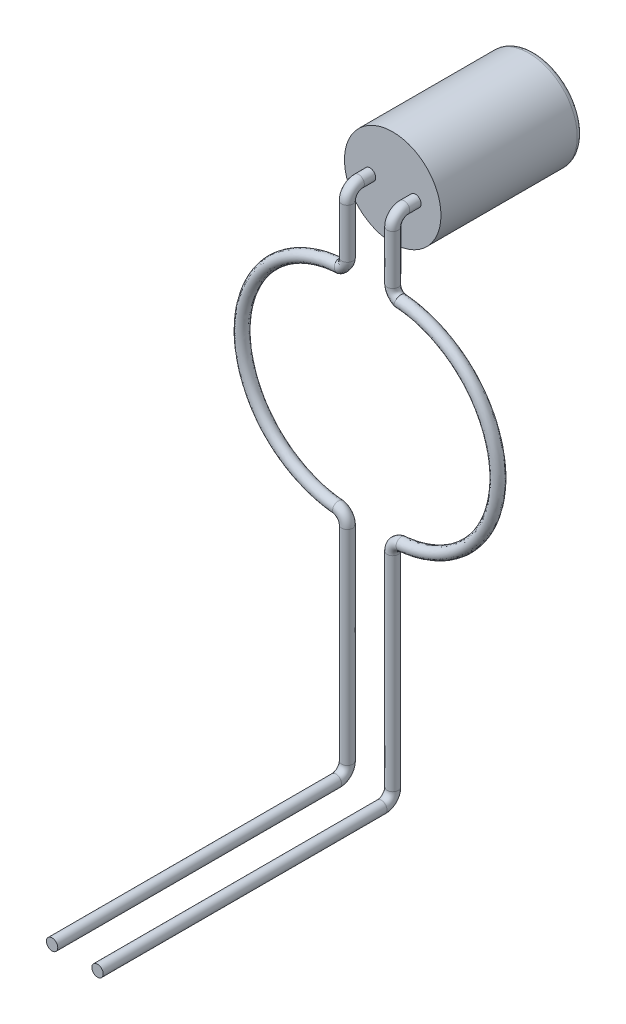
ISO-10303-21;
HEADER;
FILE_DESCRIPTION(('STEP AP214'),'2;1');
FILE_NAME('part.step','',(''),(''),'','','');
FILE_SCHEMA(('AUTOMOTIVE_DESIGN { 1 0 10303 214 1 1 1 1 }'));
ENDSEC;
DATA;
#1=APPLICATION_CONTEXT('core data for automotive mechanical design processes');
#2=APPLICATION_PROTOCOL_DEFINITION('international standard','automotive_design',2000,#1);
#3=PRODUCT_CONTEXT('',#1,'mechanical');
#4=PRODUCT('Part','Part','',(#3));
#5=PRODUCT_RELATED_PRODUCT_CATEGORY('part','',(#4));
#6=PRODUCT_DEFINITION_FORMATION('','',#4);
#7=PRODUCT_DEFINITION_CONTEXT('part definition',#1,'design');
#8=PRODUCT_DEFINITION('design','',#6,#7);
#9=PRODUCT_DEFINITION_SHAPE('','',#8);
#10=(LENGTH_UNIT() NAMED_UNIT(*) SI_UNIT(.MILLI.,.METRE.));
#11=(NAMED_UNIT(*) PLANE_ANGLE_UNIT() SI_UNIT($,.RADIAN.));
#12=(NAMED_UNIT(*) SI_UNIT($,.STERADIAN.) SOLID_ANGLE_UNIT());
#13=UNCERTAINTY_MEASURE_WITH_UNIT(LENGTH_MEASURE(1.E-05),#10,'distance_accuracy_value','');
#14=(GEOMETRIC_REPRESENTATION_CONTEXT(3) GLOBAL_UNCERTAINTY_ASSIGNED_CONTEXT((#13)) GLOBAL_UNIT_ASSIGNED_CONTEXT((#10,
#11,#12)) REPRESENTATION_CONTEXT('',''));
#15=CARTESIAN_POINT('',(0.,0.,0.));
#16=DIRECTION('',(0.,0.,1.));
#17=DIRECTION('',(1.,0.,0.));
#18=AXIS2_PLACEMENT_3D('',#15,#16,#17);
#19=CARTESIAN_POINT('',(0.,0.,1.25));
#20=DIRECTION('',(0.,0.,-1.));
#21=DIRECTION('',(-1.,0.,0.));
#22=AXIS2_PLACEMENT_3D('',#19,#20,#21);
#23=CYLINDRICAL_SURFACE('',#22,0.85);
#24=CARTESIAN_POINT('',(0.,0.,-1.15));
#25=DIRECTION('',(0.,0.,1.));
#26=DIRECTION('',(1.,0.,0.));
#27=AXIS2_PLACEMENT_3D('',#24,#25,#26);
#28=CIRCLE('',#27,0.85);
#29=CARTESIAN_POINT('',(0.85,0.,-1.15));
#30=VERTEX_POINT('',#29);
#31=EDGE_CURVE('E342',#30,#30,#28,.T.);
#32=ORIENTED_EDGE('',*,*,#31,.T.);
#33=EDGE_LOOP('',(#32));
#34=FACE_BOUND('',#33,.T.);
#35=CARTESIAN_POINT('',(0.,0.,1.25));
#36=DIRECTION('',(0.,0.,1.));
#37=DIRECTION('',(1.,0.,0.));
#38=AXIS2_PLACEMENT_3D('',#35,#36,#37);
#39=CIRCLE('',#38,0.85);
#40=CARTESIAN_POINT('',(0.85,0.,1.25));
#41=VERTEX_POINT('',#40);
#42=EDGE_CURVE('E197',#41,#41,#39,.T.);
#43=ORIENTED_EDGE('',*,*,#42,.F.);
#44=EDGE_LOOP('',(#43));
#45=FACE_BOUND('',#44,.T.);
#46=ADVANCED_FACE('F45',(#34,#45),#23,.T.);
#47=CARTESIAN_POINT('',(0.,0.,1.25));
#48=DIRECTION('',(0.,0.,1.));
#49=DIRECTION('',(1.,0.,0.));
#50=AXIS2_PLACEMENT_3D('',#47,#48,#49);
#51=PLANE('',#50);
#52=CARTESIAN_POINT('',(0.4,0.,1.25));
#53=DIRECTION('',(0.,0.,1.));
#54=DIRECTION('',(1.,0.,0.));
#55=AXIS2_PLACEMENT_3D('',#52,#53,#54);
#56=CIRCLE('',#55,0.1);
#57=CARTESIAN_POINT('',(0.5,0.,1.25));
#58=VERTEX_POINT('',#57);
#59=EDGE_CURVE('E11',#58,#58,#56,.T.);
#60=ORIENTED_EDGE('',*,*,#59,.F.);
#61=EDGE_LOOP('',(#60));
#62=FACE_BOUND('',#61,.T.);
#63=CARTESIAN_POINT('',(-0.4,0.,1.25));
#64=DIRECTION('',(0.,0.,1.));
#65=DIRECTION('',(1.,0.,0.));
#66=AXIS2_PLACEMENT_3D('',#63,#64,#65);
#67=CIRCLE('',#66,0.1);
#68=CARTESIAN_POINT('',(-0.3,0.,1.25));
#69=VERTEX_POINT('',#68);
#70=EDGE_CURVE('E53',#69,#69,#67,.T.);
#71=ORIENTED_EDGE('',*,*,#70,.F.);
#72=EDGE_LOOP('',(#71));
#73=FACE_BOUND('',#72,.T.);
#74=ORIENTED_EDGE('',*,*,#42,.T.);
#75=EDGE_LOOP('',(#74));
#76=FACE_BOUND('',#75,.T.);
#77=ADVANCED_FACE('F146',(#62,#73,#76),#51,.T.);
#78=CARTESIAN_POINT('',(0.,0.,-1.25));
#79=DIRECTION('',(0.,0.,1.));
#80=DIRECTION('',(1.,0.,0.));
#81=AXIS2_PLACEMENT_3D('',#78,#79,#80);
#82=PLANE('',#81);
#83=CARTESIAN_POINT('',(0.,0.,-1.25));
#84=DIRECTION('',(0.,0.,1.));
#85=DIRECTION('',(1.,0.,0.));
#86=AXIS2_PLACEMENT_3D('',#83,#84,#85);
#87=CIRCLE('',#86,0.75);
#88=CARTESIAN_POINT('',(0.75,0.,-1.25));
#89=VERTEX_POINT('',#88);
#90=EDGE_CURVE('E340',#89,#89,#87,.F.);
#91=ORIENTED_EDGE('',*,*,#90,.T.);
#92=EDGE_LOOP('',(#91));
#93=FACE_BOUND('',#92,.T.);
#94=ADVANCED_FACE('F152',(#93),#82,.F.);
#95=CARTESIAN_POINT('',(0.,0.,-1.15));
#96=DIRECTION('',(0.,0.,1.));
#97=DIRECTION('',(1.,0.,0.));
#98=AXIS2_PLACEMENT_3D('',#95,#96,#97);
#99=TOROIDAL_SURFACE('',#98,0.75,0.1);
#100=ORIENTED_EDGE('',*,*,#90,.F.);
#101=EDGE_LOOP('',(#100));
#102=FACE_BOUND('',#101,.T.);
#103=ORIENTED_EDGE('',*,*,#31,.F.);
#104=EDGE_LOOP('',(#103));
#105=FACE_BOUND('',#104,.T.);
#106=ADVANCED_FACE('F47',(#102,#105),#99,.T.);
#107=CARTESIAN_POINT('',(-0.399999999999998,-8.94598900638172,6.85));
#108=DIRECTION('',(0.,0.,1.));
#109=DIRECTION('',(1.,0.,0.));
#110=AXIS2_PLACEMENT_3D('',#107,#108,#109);
#111=PLANE('',#110);
#112=CARTESIAN_POINT('',(-0.399999999999998,-8.94598900638172,6.85));
#113=DIRECTION('',(0.,0.,1.));
#114=DIRECTION('',(1.,0.,0.));
#115=AXIS2_PLACEMENT_3D('',#112,#113,#114);
#116=CIRCLE('',#115,0.1);
#117=CARTESIAN_POINT('',(-0.299999999999998,-8.94598900638172,6.85));
#118=VERTEX_POINT('',#117);
#119=EDGE_CURVE('E58',#118,#118,#116,.T.);
#120=ORIENTED_EDGE('',*,*,#119,.T.);
#121=EDGE_LOOP('',(#120));
#122=FACE_BOUND('',#121,.T.);
#123=ADVANCED_FACE('F122',(#122),#111,.T.);
#124=CARTESIAN_POINT('',(-0.6,-5.14598900638171,1.65));
#125=DIRECTION('',(0.,0.,-1.));
#126=DIRECTION('',(-1.,0.,0.));
#127=AXIS2_PLACEMENT_3D('',#124,#125,#126);
#128=TOROIDAL_SURFACE('',#127,0.200000000000002,0.1);
#129=CARTESIAN_POINT('',(-0.399999999999999,-5.14598900638171,1.65));
#130=DIRECTION('',(0.,-1.,0.));
#131=DIRECTION('',(1.,0.,0.));
#132=AXIS2_PLACEMENT_3D('',#129,#130,#131);
#133=CIRCLE('',#132,0.1);
#134=CARTESIAN_POINT('',(-0.299999999999999,-5.14598900638171,1.65));
#135=VERTEX_POINT('',#134);
#136=EDGE_CURVE('E94',#135,#135,#133,.T.);
#137=ORIENTED_EDGE('',*,*,#136,.F.);
#138=EDGE_LOOP('',(#137));
#139=FACE_BOUND('',#138,.T.);
#140=CARTESIAN_POINT('',(-0.560183047886554,-4.9499925515046,1.65));
#141=DIRECTION('',(0.996254962561394,-0.086464151946315,0.));
#142=DIRECTION('',(0.0864641519463149,0.996254962561394,0.));
#143=AXIS2_PLACEMENT_3D('',#140,#141,#142);
#144=CIRCLE('',#143,0.1);
#145=CARTESIAN_POINT('',(-0.545905602260877,-4.85118068965726,1.65));
#146=VERTEX_POINT('',#145);
#147=EDGE_CURVE('E63',#146,#146,#144,.T.);
#148=ORIENTED_EDGE('',*,*,#147,.T.);
#149=EDGE_LOOP('',(#148));
#150=FACE_BOUND('',#149,.T.);
#151=ADVANCED_FACE('F162',(#139,#150),#128,.T.);
#152=CARTESIAN_POINT('',(-0.399999999999998,-5.14598900638171,1.65));
#153=DIRECTION('',(0.,-1.,0.));
#154=DIRECTION('',(0.,0.,-1.));
#155=AXIS2_PLACEMENT_3D('',#152,#153,#154);
#156=CYLINDRICAL_SURFACE('',#155,0.1);
#157=CARTESIAN_POINT('',(-0.399999999999998,-8.74598900638171,1.65));
#158=DIRECTION('',(0.,-1.,0.));
#159=DIRECTION('',(1.,0.,0.));
#160=AXIS2_PLACEMENT_3D('',#157,#158,#159);
#161=CIRCLE('',#160,0.1);
#162=CARTESIAN_POINT('',(-0.399999999999998,-8.74598900638171,1.55));
#163=VERTEX_POINT('',#162);
#164=EDGE_CURVE('E97',#163,#163,#161,.T.);
#165=ORIENTED_EDGE('',*,*,#164,.F.);
#166=EDGE_LOOP('',(#165));
#167=FACE_BOUND('',#166,.T.);
#168=ORIENTED_EDGE('',*,*,#136,.T.);
#169=EDGE_LOOP('',(#168));
#170=FACE_BOUND('',#169,.T.);
#171=ADVANCED_FACE('F171',(#167,#170),#156,.T.);
#172=CARTESIAN_POINT('',(-0.399999999999998,-8.74598900638171,1.85));
#173=DIRECTION('',(-1.,0.,0.));
#174=DIRECTION('',(0.,0.,1.));
#175=AXIS2_PLACEMENT_3D('',#172,#173,#174);
#176=TOROIDAL_SURFACE('',#175,0.200000000000001,0.1);
#177=CARTESIAN_POINT('',(-0.399999999999998,-8.94598900638171,1.85));
#178=DIRECTION('',(0.,0.,1.));
#179=DIRECTION('',(1.,0.,0.));
#180=AXIS2_PLACEMENT_3D('',#177,#178,#179);
#181=CIRCLE('',#180,0.1);
#182=CARTESIAN_POINT('',(-0.399999999999998,-9.04598900638171,1.85));
#183=VERTEX_POINT('',#182);
#184=EDGE_CURVE('E564',#183,#183,#181,.T.);
#185=CARTESIAN_POINT('',(-0.399999999999998,-8.74598900638171,1.85));
#186=DIRECTION('',(-1.,0.,0.));
#187=DIRECTION('',(0.,0.,1.));
#188=AXIS2_PLACEMENT_3D('',#185,#186,#187);
#189=CIRCLE('',#188,0.3);
#190=EDGE_CURVE('',#163,#183,#189,.T.);
#191=ORIENTED_EDGE('',*,*,#164,.T.);
#192=ORIENTED_EDGE('',*,*,#184,.F.);
#193=ORIENTED_EDGE('',*,*,#190,.T.);
#194=ORIENTED_EDGE('',*,*,#190,.F.);
#195=EDGE_LOOP('',(#191,#193,#192,#194));
#196=FACE_BOUND('',#195,.T.);
#197=ADVANCED_FACE('F167',(#196),#176,.T.);
#198=CARTESIAN_POINT('',(-0.399999999999998,-8.94598900638172,1.85));
#199=DIRECTION('',(0.,0.,1.));
#200=DIRECTION('',(1.,0.,0.));
#201=AXIS2_PLACEMENT_3D('',#198,#199,#200);
#202=CYLINDRICAL_SURFACE('',#201,0.1);
#203=ORIENTED_EDGE('',*,*,#119,.F.);
#204=EDGE_LOOP('',(#203));
#205=FACE_BOUND('',#204,.T.);
#206=ORIENTED_EDGE('',*,*,#184,.T.);
#207=EDGE_LOOP('',(#206));
#208=FACE_BOUND('',#207,.T.);
#209=ADVANCED_FACE('F163',(#205,#208),#202,.T.);
#210=CARTESIAN_POINT('',(-0.320313914255039,-1.3421668293797,1.65));
#211=CARTESIAN_POINT('',(-0.386824528835957,-1.3467256222584,1.65));
#212=CARTESIAN_POINT('',(-0.455131011311232,-1.35139897748724,1.65));
#213=CARTESIAN_POINT('',(-0.968453973995265,-1.38665099806308,1.65));
#214=CARTESIAN_POINT('',(-1.37636483013981,-1.58494097054743,1.65));
#215=CARTESIAN_POINT('',(-1.97464763676664,-2.21983956312003,1.65));
#216=CARTESIAN_POINT('',(-2.14856734212054,-2.65227258517285,1.65));
#217=CARTESIAN_POINT('',(-2.15647835242533,-3.52461247584773,1.65));
#218=CARTESIAN_POINT('',(-1.9904298387068,-3.96012857608279,1.65));
#219=CARTESIAN_POINT('',(-1.40375992577032,-4.60577317864002,1.65));
#220=CARTESIAN_POINT('',(-0.987092950947682,-4.81256547595763,1.65));
#221=CARTESIAN_POINT('',(-0.551536632691923,-4.85036705524846,1.65));
#222=CARTESIAN_POINT('',(-0.320313914255039,-1.3421668293797,1.85));
#223=CARTESIAN_POINT('',(-0.386824528835957,-1.3467256222584,1.85));
#224=CARTESIAN_POINT('',(-0.455131011311232,-1.35139897748724,1.85));
#225=CARTESIAN_POINT('',(-0.968453973995265,-1.38665099806308,1.85));
#226=CARTESIAN_POINT('',(-1.37636483013981,-1.58494097054743,1.85));
#227=CARTESIAN_POINT('',(-1.97464763676664,-2.21983956312003,1.85));
#228=CARTESIAN_POINT('',(-2.14856734212049,-2.65227258517285,1.85));
#229=CARTESIAN_POINT('',(-2.15647835242538,-3.52461247584773,1.85));
#230=CARTESIAN_POINT('',(-1.9904298387068,-3.96012857608279,1.85));
#231=CARTESIAN_POINT('',(-1.40375992577032,-4.60577317864002,1.85));
#232=CARTESIAN_POINT('',(-0.987092950947782,-4.81256547595773,1.85));
#233=CARTESIAN_POINT('',(-0.551536632691923,-4.85036705524846,1.85));
#234=CARTESIAN_POINT('',(-0.333990292891106,-1.1426349856369,1.85));
#235=CARTESIAN_POINT('',(-0.400500907472024,-1.1471937785156,1.85));
#236=CARTESIAN_POINT('',(-0.465217348780653,-1.15162009045159,1.85));
#237=CARTESIAN_POINT('',(-1.00701682821201,-1.18883167977311,1.85));
#238=CARTESIAN_POINT('',(-1.48778416885489,-1.4115529619925,1.85));
#239=CARTESIAN_POINT('',(-2.15434091635022,-2.11890396082949,1.85));
#240=CARTESIAN_POINT('',(-2.34810773004086,-2.60068472654156,1.85));
#241=CARTESIAN_POINT('',(-2.35692151716598,-3.57257299375931,1.85));
#242=CARTESIAN_POINT('',(-2.17192412796356,-4.05778866774967,1.85));
#243=CARTESIAN_POINT('',(-1.51830549696017,-4.77711197363766,1.85));
#244=CARTESIAN_POINT('',(-1.05408994463249,-5.00750268448573,1.85));
#245=CARTESIAN_POINT('',(-0.568829463081186,-5.04961804776074,1.85));
#246=CARTESIAN_POINT('',(-0.333990292891106,-1.1426349856369,1.65));
#247=CARTESIAN_POINT('',(-0.400500907472024,-1.1471937785156,1.65));
#248=CARTESIAN_POINT('',(-0.465217348780653,-1.15162009045159,1.65));
#249=CARTESIAN_POINT('',(-1.00701682821201,-1.18883167977311,1.65));
#250=CARTESIAN_POINT('',(-1.48778416885489,-1.4115529619925,1.65));
#251=CARTESIAN_POINT('',(-2.15434091635022,-2.11890396082949,1.65));
#252=CARTESIAN_POINT('',(-2.34810773004091,-2.60068472654156,1.65));
#253=CARTESIAN_POINT('',(-2.35692151716593,-3.57257299375931,1.65));
#254=CARTESIAN_POINT('',(-2.17192412796353,-4.05778866774967,1.65));
#255=CARTESIAN_POINT('',(-1.51830549696019,-4.77711197363766,1.65));
#256=CARTESIAN_POINT('',(-1.05408994463249,-5.00750268448573,1.65));
#257=CARTESIAN_POINT('',(-0.568829463081186,-5.04961804776074,1.65));
#258=CARTESIAN_POINT('',(-0.333990292891106,-1.1426349856369,1.45));
#259=CARTESIAN_POINT('',(-0.400500907472024,-1.1471937785156,1.45));
#260=CARTESIAN_POINT('',(-0.465217348780653,-1.15162009045159,1.45));
#261=CARTESIAN_POINT('',(-1.00701682821201,-1.18883167977311,1.45));
#262=CARTESIAN_POINT('',(-1.48778416885489,-1.4115529619925,1.45));
#263=CARTESIAN_POINT('',(-2.15434091635022,-2.11890396082949,1.45));
#264=CARTESIAN_POINT('',(-2.34810773004096,-2.60068472654156,1.45));
#265=CARTESIAN_POINT('',(-2.35692151716588,-3.57257299375931,1.45));
#266=CARTESIAN_POINT('',(-2.17192412796351,-4.05778866774967,1.45));
#267=CARTESIAN_POINT('',(-1.51830549696022,-4.77711197363766,1.45));
#268=CARTESIAN_POINT('',(-1.05408994463249,-5.00750268448573,1.45));
#269=CARTESIAN_POINT('',(-0.568829463081186,-5.04961804776074,1.45));
#270=CARTESIAN_POINT('',(-0.320313914255039,-1.3421668293797,1.45));
#271=CARTESIAN_POINT('',(-0.386824528835957,-1.3467256222584,1.45));
#272=CARTESIAN_POINT('',(-0.455131011311232,-1.35139897748724,1.45));
#273=CARTESIAN_POINT('',(-0.968453973995265,-1.38665099806308,1.45));
#274=CARTESIAN_POINT('',(-1.37636483013981,-1.58494097054743,1.45));
#275=CARTESIAN_POINT('',(-1.97464763676664,-2.21983956312003,1.45));
#276=CARTESIAN_POINT('',(-2.14856734212059,-2.65227258517285,1.45));
#277=CARTESIAN_POINT('',(-2.15647835242528,-3.52461247584773,1.45));
#278=CARTESIAN_POINT('',(-1.9904298387068,-3.96012857608279,1.45));
#279=CARTESIAN_POINT('',(-1.40375992577032,-4.60577317864002,1.45));
#280=CARTESIAN_POINT('',(-0.987092950947582,-4.81256547595753,1.45));
#281=CARTESIAN_POINT('',(-0.551536632691923,-4.85036705524846,1.45));
#282=CARTESIAN_POINT('',(-0.320313914255039,-1.3421668293797,1.65));
#283=CARTESIAN_POINT('',(-0.386824528835957,-1.3467256222584,1.65));
#284=CARTESIAN_POINT('',(-0.455131011311232,-1.35139897748724,1.65));
#285=CARTESIAN_POINT('',(-0.968453973995265,-1.38665099806308,1.65));
#286=CARTESIAN_POINT('',(-1.37636483013981,-1.58494097054743,1.65));
#287=CARTESIAN_POINT('',(-1.97464763676664,-2.21983956312003,1.65));
#288=CARTESIAN_POINT('',(-2.14856734212054,-2.65227258517285,1.65));
#289=CARTESIAN_POINT('',(-2.15647835242533,-3.52461247584773,1.65));
#290=CARTESIAN_POINT('',(-1.9904298387068,-3.96012857608279,1.65));
#291=CARTESIAN_POINT('',(-1.40375992577032,-4.60577317864002,1.65));
#292=CARTESIAN_POINT('',(-0.987092950947682,-4.81256547595763,1.65));
#293=CARTESIAN_POINT('',(-0.551536632691923,-4.85036705524846,1.65));
#294=(BOUNDED_SURFACE() B_SPLINE_SURFACE(3,3,((#210,#211,#212,#213,#214,#215,#216,#217,#218,
#219,#220,#221),(#222,#223,#224,#225,#226,#227,#228,#229,#230,#231,#232,#233),(#234,#235,#236,
#237,#238,#239,#240,#241,#242,#243,#244,#245),(#246,#247,#248,#249,#250,#251,#252,#253,#254,
#255,#256,#257),(#258,#259,#260,#261,#262,#263,#264,#265,#266,#267,#268,#269),(#270,#271,#272,
#273,#274,#275,#276,#277,#278,#279,#280,#281),(#282,#283,#284,#285,#286,#287,#288,#289,#290,
#291,#292,#293)),.UNSPECIFIED.,.T.,.F.,.F.) B_SPLINE_SURFACE_WITH_KNOTS((4,3,4),(4,2,2,2,2,4),
(0.,0.5,1.),(-0.0360641782622766,0.,0.25,0.5,0.75,1.),
.UNSPECIFIED.) GEOMETRIC_REPRESENTATION_ITEM() RATIONAL_B_SPLINE_SURFACE(((1.,1.,1.,1.,1.,1.,1.,
1.,1.,1.,1.,1.),(0.333333333333333,0.333333333333333,0.333333333333333,0.333333333333333,
0.333333333333333,0.333333333333333,0.333333333333333,0.333333333333333,0.333333333333333,
0.333333333333333,0.333333333333333,0.333333333333333),(0.333333333333333,0.333333333333333,
0.333333333333333,0.333333333333333,0.333333333333333,0.333333333333333,0.333333333333333,
0.333333333333333,0.333333333333333,0.333333333333333,0.333333333333333,0.333333333333333),(1.,
1.,1.,1.,1.,1.,1.,1.,1.,1.,1.,1.),(0.333333333333333,0.333333333333333,0.333333333333333,
0.333333333333333,0.333333333333333,0.333333333333333,0.333333333333333,0.333333333333333,
0.333333333333333,0.333333333333333,0.333333333333333,0.333333333333333),(0.333333333333333,
0.333333333333333,0.333333333333333,0.333333333333333,0.333333333333333,0.333333333333333,
0.333333333333333,0.333333333333333,0.333333333333333,0.333333333333333,0.333333333333333,
0.333333333333333),(1.,1.,1.,1.,1.,1.,1.,1.,1.,1.,1.,1.))) REPRESENTATION_ITEM('') SURFACE());
#295=CARTESIAN_POINT('',(-0.526683947315875,-1.25607728614437,1.55));
#296=CARTESIAN_POINT('',(-0.526416853962726,-1.25725743200403,1.54999945477346));
#297=CARTESIAN_POINT('',(-0.526149515452099,-1.25843865126105,1.55002098814878));
#298=CARTESIAN_POINT('',(-0.523151952408598,-1.27168309963214,1.55050810587876));
#299=CARTESIAN_POINT('',(-0.520416785252301,-1.28376719966588,1.55323687924054));
#300=CARTESIAN_POINT('',(-0.515545462847435,-1.30528780991801,1.56256131623488));
#301=CARTESIAN_POINT('',(-0.5133798274527,-1.31485464896088,1.5688529763735));
#302=CARTESIAN_POINT('',(-0.509651927393527,-1.33132244663684,1.58430611407469));
#303=CARTESIAN_POINT('',(-0.508084723168472,-1.3382452299072,1.5934429149672));
#304=CARTESIAN_POINT('',(-0.505735805218788,-1.34862094142141,1.6134579751396));
#305=CARTESIAN_POINT('',(-0.504945149076069,-1.35211337226941,1.62431469550801));
#306=CARTESIAN_POINT('',(-0.50421694911252,-1.35532992845187,1.64649164066506));
#307=CARTESIAN_POINT('',(-0.504271116002822,-1.35509066862818,1.65780627661743));
#308=CARTESIAN_POINT('',(-0.505203929941744,-1.35097029908951,1.67967041241208));
#309=CARTESIAN_POINT('',(-0.506079597249567,-1.34710235132699,1.69022252914732));
#310=CARTESIAN_POINT('',(-0.50855226210093,-1.33617997749352,1.70947546897725));
#311=CARTESIAN_POINT('',(-0.510152197741929,-1.32911257236364,1.71816853696748));
#312=CARTESIAN_POINT('',(-0.513928311275905,-1.31243169322777,1.73287772186388));
#313=CARTESIAN_POINT('',(-0.516116324004702,-1.30276592734387,1.73883115010044));
#314=CARTESIAN_POINT('',(-0.520829289634877,-1.28194473454604,1.74716931815929));
#315=CARTESIAN_POINT('',(-0.52335672014041,-1.2707783533225,1.74952607042707));
#316=CARTESIAN_POINT('',(-0.52614948929866,-1.25843876676343,1.74997891225516));
#317=CARTESIAN_POINT('',(-0.526416826865292,-1.25725755167308,1.7500004391514));
#318=CARTESIAN_POINT('',(-0.526683947315876,-1.25607728614437,1.75));
#319=B_SPLINE_CURVE_WITH_KNOTS('',3,(#295,#296,#297,#298,#299,#300,#301,#302,#303,#304,#305,
#306,#307,#308,#309,#310,#311,#312,#313,#314,#315,#316,#317,#318),.UNSPECIFIED.,.F.,.F.,(4,2,2,
2,2,2,2,2,2,2,2,4),(0.,0.00363296038412161,0.040727683527187,0.0750521251887425,
0.109086785135364,0.142724752316014,0.1760328777563,0.2092206533923,0.242544283442033,
0.276596547390638,0.310912461908523,0.314545422292646),.UNSPECIFIED.);
#320=CARTESIAN_POINT('',(-0.526683947315876,-1.25607728614437,1.75));
#321=VERTEX_POINT('',#320);
#322=CARTESIAN_POINT('',(-0.526683947315875,-1.25607728614437,1.55));
#323=VERTEX_POINT('',#322);
#324=EDGE_CURVE('E221',#321,#323,#319,.F.);
#325=CARTESIAN_POINT('',(-0.526683947315875,-1.25607728614437,1.55));
#326=CARTESIAN_POINT('',(-0.526951011568328,-1.25489711858859,1.54999947834686));
#327=CARTESIAN_POINT('',(-0.527219302755635,-1.25371611674632,1.55002100826793));
#328=CARTESIAN_POINT('',(-0.530237637364436,-1.24047709489119,1.55050773945927));
#329=CARTESIAN_POINT('',(-0.533086713823957,-1.22842068802513,1.55323290431081));
#330=CARTESIAN_POINT('',(-0.538220269939352,-1.20693489410127,1.56254755087526));
#331=CARTESIAN_POINT('',(-0.54053078977885,-1.19737794034182,1.56884020420876));
#332=CARTESIAN_POINT('',(-0.544469977956386,-1.18092774067056,1.58430618434828));
#333=CARTESIAN_POINT('',(-0.546104698873244,-1.17401089441268,1.59345259298921));
#334=CARTESIAN_POINT('',(-0.548503918550857,-1.16366132082313,1.61346218977642));
#335=CARTESIAN_POINT('',(-0.549280775302423,-1.16017919494375,1.6242983603883));
#336=CARTESIAN_POINT('',(-0.550000342610874,-1.15696137978385,1.64644787683648));
#337=CARTESIAN_POINT('',(-0.549949876718125,-1.15719504312278,1.65775655265758));
#338=CARTESIAN_POINT('',(-0.549028611683749,-1.16130253468337,1.6796404101379));
#339=CARTESIAN_POINT('',(-0.548158903426399,-1.16517152217384,1.69021654712764));
#340=CARTESIAN_POINT('',(-0.545617057652538,-1.17608540219437,1.7094810124055));
#341=CARTESIAN_POINT('',(-0.543943695003785,-1.18313514263175,1.71816642890583));
#342=CARTESIAN_POINT('',(-0.53998346628731,-1.19964931718217,1.7327636486787));
#343=CARTESIAN_POINT('',(-0.537691382203206,-1.20913425374877,1.73865062811258));
#344=CARTESIAN_POINT('',(-0.532740627117323,-1.22988584252071,1.74709535873414));
#345=CARTESIAN_POINT('',(-0.530071417990582,-1.24120604983144,1.74951970690956));
#346=CARTESIAN_POINT('',(-0.527219324528623,-1.25371603361262,1.74997892129478));
#347=CARTESIAN_POINT('',(-0.526951034038423,-1.25489703309873,1.75000044705368));
#348=CARTESIAN_POINT('',(-0.526683947315876,-1.25607728614437,1.75));
#349=B_SPLINE_CURVE_WITH_KNOTS('',3,(#325,#326,#327,#328,#329,#330,#331,#332,#333,#334,#335,
#336,#337,#338,#339,#340,#341,#342,#343,#344,#345,#346,#347,#348),.UNSPECIFIED.,.F.,.F.,(4,2,2,
2,2,2,2,2,2,2,2,4),(0.,0.00363296129542657,0.0407260078495858,0.0751094271185845,
0.109177857458853,0.142748838826554,0.176043075449436,0.20929304081002,0.242593855808893,
0.276184797826031,0.311037879845327,0.314670841140304),.UNSPECIFIED.);
#350=EDGE_CURVE('E223',#321,#323,#349,.F.);
#351=ORIENTED_EDGE('',*,*,#324,.F.);
#352=ORIENTED_EDGE('',*,*,#350,.T.);
#353=EDGE_LOOP('',(#351,#352));
#354=FACE_BOUND('',#353,.T.);
#355=ORIENTED_EDGE('',*,*,#147,.F.);
#356=EDGE_LOOP('',(#355));
#357=FACE_BOUND('',#356,.T.);
#358=ADVANCED_FACE('F166',(#354,#357),#294,.T.);
#359=CARTESIAN_POINT('',(-0.4,0.,1.25));
#360=DIRECTION('',(0.,0.,1.));
#361=DIRECTION('',(1.,0.,0.));
#362=AXIS2_PLACEMENT_3D('',#359,#360,#361);
#363=CYLINDRICAL_SURFACE('',#362,0.1);
#364=CARTESIAN_POINT('',(-0.4,0.,1.45));
#365=DIRECTION('',(0.,0.,1.));
#366=DIRECTION('',(1.,0.,0.));
#367=AXIS2_PLACEMENT_3D('',#364,#365,#366);
#368=CIRCLE('',#367,0.1);
#369=CARTESIAN_POINT('',(-0.4,0.1,1.45));
#370=VERTEX_POINT('',#369);
#371=EDGE_CURVE('E196',#370,#370,#368,.T.);
#372=ORIENTED_EDGE('',*,*,#371,.F.);
#373=EDGE_LOOP('',(#372));
#374=FACE_BOUND('',#373,.T.);
#375=ORIENTED_EDGE('',*,*,#70,.T.);
#376=EDGE_LOOP('',(#375));
#377=FACE_BOUND('',#376,.T.);
#378=ADVANCED_FACE('F212',(#374,#377),#363,.T.);
#379=CARTESIAN_POINT('',(-0.4,-0.2,1.45));
#380=DIRECTION('',(1.,0.,0.));
#381=DIRECTION('',(0.,0.,-1.));
#382=AXIS2_PLACEMENT_3D('',#379,#380,#381);
#383=TOROIDAL_SURFACE('',#382,0.2,0.1);
#384=CARTESIAN_POINT('',(-0.4,-0.2,1.65));
#385=DIRECTION('',(0.,-1.,0.));
#386=DIRECTION('',(1.,0.,0.));
#387=AXIS2_PLACEMENT_3D('',#384,#385,#386);
#388=CIRCLE('',#387,0.1);
#389=CARTESIAN_POINT('',(-0.4,-0.2,1.75));
#390=VERTEX_POINT('',#389);
#391=EDGE_CURVE('E231',#390,#390,#388,.T.);
#392=CARTESIAN_POINT('',(-0.4,-0.2,1.45));
#393=DIRECTION('',(1.,0.,0.));
#394=DIRECTION('',(0.,0.,-1.));
#395=AXIS2_PLACEMENT_3D('',#392,#393,#394);
#396=CIRCLE('',#395,0.3);
#397=EDGE_CURVE('',#370,#390,#396,.T.);
#398=ORIENTED_EDGE('',*,*,#371,.T.);
#399=ORIENTED_EDGE('',*,*,#391,.F.);
#400=ORIENTED_EDGE('',*,*,#397,.T.);
#401=ORIENTED_EDGE('',*,*,#397,.F.);
#402=EDGE_LOOP('',(#398,#400,#399,#401));
#403=FACE_BOUND('',#402,.T.);
#404=ADVANCED_FACE('F217',(#403),#383,.T.);
#405=CARTESIAN_POINT('',(-0.4,-0.2,1.65));
#406=DIRECTION('',(0.,-1.,0.));
#407=DIRECTION('',(0.,0.,-1.));
#408=AXIS2_PLACEMENT_3D('',#405,#406,#407);
#409=CYLINDRICAL_SURFACE('',#408,0.1);
#410=CARTESIAN_POINT('',(-0.4,-1.07,1.65));
#411=DIRECTION('',(0.,-1.,0.));
#412=DIRECTION('',(1.,0.,0.));
#413=AXIS2_PLACEMENT_3D('',#410,#411,#412);
#414=CIRCLE('',#413,0.1);
#415=CARTESIAN_POINT('',(-0.3,-1.07,1.65));
#416=VERTEX_POINT('',#415);
#417=EDGE_CURVE('E228',#416,#416,#414,.T.);
#418=ORIENTED_EDGE('',*,*,#417,.F.);
#419=EDGE_LOOP('',(#418));
#420=FACE_BOUND('',#419,.T.);
#421=ORIENTED_EDGE('',*,*,#391,.T.);
#422=EDGE_LOOP('',(#421));
#423=FACE_BOUND('',#422,.T.);
#424=ADVANCED_FACE('F252',(#420,#423),#409,.T.);
#425=CARTESIAN_POINT('',(-0.3,-1.07,1.65));
#426=CARTESIAN_POINT('',(-0.3,-1.16962213238677,1.65));
#427=CARTESIAN_POINT('',(-0.396075480806249,-1.31193580295551,1.65));
#428=CARTESIAN_POINT('',(-0.567500778193534,-1.37977597687934,1.65));
#429=CARTESIAN_POINT('',(-0.614077445069928,-1.39799329767264,1.65));
#430=CARTESIAN_POINT('',(-0.676103207118016,-1.4224319819007,1.65));
#431=CARTESIAN_POINT('',(-0.3,-1.07,1.85));
#432=CARTESIAN_POINT('',(-0.3,-1.16962213238677,1.85));
#433=CARTESIAN_POINT('',(-0.396075480806249,-1.31193580295551,1.85));
#434=CARTESIAN_POINT('',(-0.567500778193534,-1.37977597687934,1.85));
#435=CARTESIAN_POINT('',(-0.614077445069928,-1.39799329767264,1.85));
#436=CARTESIAN_POINT('',(-0.676103207118016,-1.4224319819007,1.85));
#437=CARTESIAN_POINT('',(-0.5,-1.07,1.85));
#438=CARTESIAN_POINT('',(-0.5,-1.12977327943208,1.85));
#439=CARTESIAN_POINT('',(-0.506953165494128,-1.14076668586535,1.85));
#440=CARTESIAN_POINT('',(-0.609842180080612,-1.18140488703589,1.85));
#441=CARTESIAN_POINT('',(-0.687393497754135,-1.2119160115284,1.85));
#442=CARTESIAN_POINT('',(-0.749419259802224,-1.23635469575645,1.85));
#443=CARTESIAN_POINT('',(-0.5,-1.07,1.65));
#444=CARTESIAN_POINT('',(-0.5,-1.12977327943208,1.65));
#445=CARTESIAN_POINT('',(-0.506953165494128,-1.14076668586535,1.65));
#446=CARTESIAN_POINT('',(-0.609842180080612,-1.18140488703589,1.65));
#447=CARTESIAN_POINT('',(-0.687393497754135,-1.2119160115284,1.65));
#448=CARTESIAN_POINT('',(-0.749419259802224,-1.23635469575645,1.65));
#449=CARTESIAN_POINT('',(-0.5,-1.07,1.45));
#450=CARTESIAN_POINT('',(-0.5,-1.12977327943208,1.45));
#451=CARTESIAN_POINT('',(-0.506953165494128,-1.14076668586535,1.45));
#452=CARTESIAN_POINT('',(-0.609842180080612,-1.18140488703589,1.45));
#453=CARTESIAN_POINT('',(-0.687393497754135,-1.2119160115284,1.45));
#454=CARTESIAN_POINT('',(-0.749419259802224,-1.23635469575645,1.45));
#455=CARTESIAN_POINT('',(-0.3,-1.07,1.45));
#456=CARTESIAN_POINT('',(-0.3,-1.16962213238677,1.45));
#457=CARTESIAN_POINT('',(-0.396075480806249,-1.31193580295551,1.45));
#458=CARTESIAN_POINT('',(-0.567500778193534,-1.37977597687934,1.45));
#459=CARTESIAN_POINT('',(-0.614077445069928,-1.39799329767264,1.45));
#460=CARTESIAN_POINT('',(-0.676103207118016,-1.4224319819007,1.45));
#461=CARTESIAN_POINT('',(-0.3,-1.07,1.65));
#462=CARTESIAN_POINT('',(-0.3,-1.16962213238677,1.65));
#463=CARTESIAN_POINT('',(-0.396075480806249,-1.31193580295551,1.65));
#464=CARTESIAN_POINT('',(-0.567500778193534,-1.37977597687934,1.65));
#465=CARTESIAN_POINT('',(-0.614077445069928,-1.39799329767264,1.65));
#466=CARTESIAN_POINT('',(-0.676103207118016,-1.4224319819007,1.65));
#467=(BOUNDED_SURFACE() B_SPLINE_SURFACE(3,3,((#425,#426,#427,#428,#429,#430),(#431,#432,#433,
#434,#435,#436),(#437,#438,#439,#440,#441,#442),(#443,#444,#445,#446,#447,#448),(#449,#450,#451,
#452,#453,#454),(#455,#456,#457,#458,#459,#460),(#461,#462,#463,#464,#465,#466)),.UNSPECIFIED.,
.T.,.F.,.F.) B_SPLINE_SURFACE_WITH_KNOTS((4,3,4),(4,2,4),(0.,0.5,1.),(0.852707366876897,1.,
1.12146271694297),.UNSPECIFIED.) GEOMETRIC_REPRESENTATION_ITEM() RATIONAL_B_SPLINE_SURFACE(((1.,
1.,1.,1.,1.,1.),(0.333333333333333,0.333333333333333,0.333333333333333,0.333333333333333,
0.333333333333333,0.333333333333333),(0.333333333333333,0.333333333333333,0.333333333333333,
0.333333333333333,0.333333333333333,0.333333333333333),(1.,1.,1.,1.,1.,1.),(0.333333333333333,
0.333333333333333,0.333333333333333,0.333333333333333,0.333333333333333,0.333333333333333),
(0.333333333333333,0.333333333333333,0.333333333333333,0.333333333333333,0.333333333333333,
0.333333333333333),(1.,1.,1.,1.,1.,1.))) REPRESENTATION_ITEM('') SURFACE());
#468=ORIENTED_EDGE('',*,*,#350,.F.);
#469=ORIENTED_EDGE('',*,*,#324,.T.);
#470=EDGE_LOOP('',(#468,#469));
#471=FACE_BOUND('',#470,.T.);
#472=ORIENTED_EDGE('',*,*,#417,.T.);
#473=EDGE_LOOP('',(#472));
#474=FACE_BOUND('',#473,.T.);
#475=ADVANCED_FACE('F226',(#471,#474),#467,.T.);
#476=CARTESIAN_POINT('',(0.399999999999998,-8.94598900638172,6.85));
#477=DIRECTION('',(0.,0.,1.));
#478=DIRECTION('',(-1.,0.,0.));
#479=AXIS2_PLACEMENT_3D('',#476,#477,#478);
#480=PLANE('',#479);
#481=CARTESIAN_POINT('',(0.399999999999998,-8.94598900638172,6.85));
#482=DIRECTION('',(0.,0.,-1.));
#483=DIRECTION('',(-1.,0.,0.));
#484=AXIS2_PLACEMENT_3D('',#481,#482,#483);
#485=CIRCLE('',#484,0.1);
#486=CARTESIAN_POINT('',(0.299999999999998,-8.94598900638172,6.85));
#487=VERTEX_POINT('',#486);
#488=EDGE_CURVE('E301',#487,#487,#485,.F.);
#489=ORIENTED_EDGE('',*,*,#488,.T.);
#490=EDGE_LOOP('',(#489));
#491=FACE_BOUND('',#490,.T.);
#492=ADVANCED_FACE('F251',(#491),#480,.T.);
#493=CARTESIAN_POINT('',(0.6,-5.14598900638171,1.65));
#494=DIRECTION('',(0.,0.,1.));
#495=DIRECTION('',(1.,0.,0.));
#496=AXIS2_PLACEMENT_3D('',#493,#494,#495);
#497=TOROIDAL_SURFACE('',#496,0.200000000000002,0.1);
#498=CARTESIAN_POINT('',(0.399999999999999,-5.14598900638171,1.65));
#499=DIRECTION('',(0.,1.,0.));
#500=DIRECTION('',(-1.,0.,0.));
#501=AXIS2_PLACEMENT_3D('',#498,#499,#500);
#502=CIRCLE('',#501,0.1);
#503=CARTESIAN_POINT('',(0.299999999999999,-5.14598900638171,1.65));
#504=VERTEX_POINT('',#503);
#505=EDGE_CURVE('E321',#504,#504,#502,.F.);
#506=ORIENTED_EDGE('',*,*,#505,.F.);
#507=EDGE_LOOP('',(#506));
#508=FACE_BOUND('',#507,.T.);
#509=CARTESIAN_POINT('',(0.560183047886554,-4.9499925515046,1.65));
#510=DIRECTION('',(0.996254962561394,0.086464151946315,0.));
#511=DIRECTION('',(-0.0864641519463149,0.996254962561394,0.));
#512=AXIS2_PLACEMENT_3D('',#509,#510,#511);
#513=CIRCLE('',#512,0.1);
#514=CARTESIAN_POINT('',(0.545905602260877,-4.85118068965726,1.65));
#515=VERTEX_POINT('',#514);
#516=EDGE_CURVE('E292',#515,#515,#513,.F.);
#517=ORIENTED_EDGE('',*,*,#516,.T.);
#518=EDGE_LOOP('',(#517));
#519=FACE_BOUND('',#518,.T.);
#520=ADVANCED_FACE('F267',(#508,#519),#497,.T.);
#521=CARTESIAN_POINT('',(0.399999999999998,-5.14598900638171,1.65));
#522=DIRECTION('',(0.,-1.,0.));
#523=DIRECTION('',(0.,0.,-1.));
#524=AXIS2_PLACEMENT_3D('',#521,#522,#523);
#525=CYLINDRICAL_SURFACE('',#524,0.1);
#526=CARTESIAN_POINT('',(0.399999999999998,-8.74598900638171,1.65));
#527=DIRECTION('',(0.,1.,0.));
#528=DIRECTION('',(-1.,0.,0.));
#529=AXIS2_PLACEMENT_3D('',#526,#527,#528);
#530=CIRCLE('',#529,0.1);
#531=CARTESIAN_POINT('',(0.399999999999998,-8.74598900638171,1.55));
#532=VERTEX_POINT('',#531);
#533=EDGE_CURVE('E319',#532,#532,#530,.F.);
#534=ORIENTED_EDGE('',*,*,#533,.F.);
#535=EDGE_LOOP('',(#534));
#536=FACE_BOUND('',#535,.T.);
#537=ORIENTED_EDGE('',*,*,#505,.T.);
#538=EDGE_LOOP('',(#537));
#539=FACE_BOUND('',#538,.T.);
#540=ADVANCED_FACE('F275',(#536,#539),#525,.T.);
#541=CARTESIAN_POINT('',(0.399999999999998,-8.74598900638171,1.85));
#542=DIRECTION('',(-1.,0.,0.));
#543=DIRECTION('',(0.,0.,1.));
#544=AXIS2_PLACEMENT_3D('',#541,#542,#543);
#545=TOROIDAL_SURFACE('',#544,0.200000000000001,0.1);
#546=CARTESIAN_POINT('',(0.399999999999998,-8.94598900638171,1.85));
#547=DIRECTION('',(0.,0.,-1.));
#548=DIRECTION('',(-1.,0.,0.));
#549=AXIS2_PLACEMENT_3D('',#546,#547,#548);
#550=CIRCLE('',#549,0.1);
#551=CARTESIAN_POINT('',(0.399999999999998,-9.04598900638171,1.85));
#552=VERTEX_POINT('',#551);
#553=EDGE_CURVE('E316',#552,#552,#550,.F.);
#554=CARTESIAN_POINT('',(0.399999999999998,-8.74598900638171,1.85));
#555=DIRECTION('',(-1.,0.,0.));
#556=DIRECTION('',(0.,0.,1.));
#557=AXIS2_PLACEMENT_3D('',#554,#555,#556);
#558=CIRCLE('',#557,0.3);
#559=EDGE_CURVE('',#532,#552,#558,.T.);
#560=ORIENTED_EDGE('',*,*,#533,.T.);
#561=ORIENTED_EDGE('',*,*,#553,.F.);
#562=ORIENTED_EDGE('',*,*,#559,.T.);
#563=ORIENTED_EDGE('',*,*,#559,.F.);
#564=EDGE_LOOP('',(#560,#562,#561,#563));
#565=FACE_BOUND('',#564,.T.);
#566=ADVANCED_FACE('F271',(#565),#545,.T.);
#567=CARTESIAN_POINT('',(0.399999999999998,-8.94598900638172,1.85));
#568=DIRECTION('',(0.,0.,1.));
#569=DIRECTION('',(1.,0.,0.));
#570=AXIS2_PLACEMENT_3D('',#567,#568,#569);
#571=CYLINDRICAL_SURFACE('',#570,0.1);
#572=ORIENTED_EDGE('',*,*,#488,.F.);
#573=EDGE_LOOP('',(#572));
#574=FACE_BOUND('',#573,.T.);
#575=ORIENTED_EDGE('',*,*,#553,.T.);
#576=EDGE_LOOP('',(#575));
#577=FACE_BOUND('',#576,.T.);
#578=ADVANCED_FACE('F142',(#574,#577),#571,.T.);
#579=CARTESIAN_POINT('',(0.320313914255039,-1.3421668293797,1.65));
#580=CARTESIAN_POINT('',(0.386824528835957,-1.3467256222584,1.65));
#581=CARTESIAN_POINT('',(0.455131011311232,-1.35139897748724,1.65));
#582=CARTESIAN_POINT('',(0.968453973995265,-1.38665099806308,1.65));
#583=CARTESIAN_POINT('',(1.37636483013981,-1.58494097054743,1.65));
#584=CARTESIAN_POINT('',(1.97464763676664,-2.21983956312003,1.65));
#585=CARTESIAN_POINT('',(2.14856734212054,-2.65227258517285,1.65));
#586=CARTESIAN_POINT('',(2.15647835242533,-3.52461247584773,1.65));
#587=CARTESIAN_POINT('',(1.9904298387068,-3.96012857608279,1.65));
#588=CARTESIAN_POINT('',(1.40375992577032,-4.60577317864002,1.65));
#589=CARTESIAN_POINT('',(0.987092950947682,-4.81256547595763,1.65));
#590=CARTESIAN_POINT('',(0.551536632691923,-4.85036705524846,1.65));
#591=CARTESIAN_POINT('',(0.320313914255039,-1.3421668293797,1.45));
#592=CARTESIAN_POINT('',(0.386824528835957,-1.3467256222584,1.45));
#593=CARTESIAN_POINT('',(0.455131011311232,-1.35139897748724,1.45));
#594=CARTESIAN_POINT('',(0.968453973995265,-1.38665099806308,1.45));
#595=CARTESIAN_POINT('',(1.37636483013981,-1.58494097054743,1.45));
#596=CARTESIAN_POINT('',(1.97464763676664,-2.21983956312003,1.45));
#597=CARTESIAN_POINT('',(2.14856734212059,-2.65227258517285,1.45));
#598=CARTESIAN_POINT('',(2.15647835242528,-3.52461247584773,1.45));
#599=CARTESIAN_POINT('',(1.9904298387068,-3.96012857608279,1.45));
#600=CARTESIAN_POINT('',(1.40375992577032,-4.60577317864002,1.45));
#601=CARTESIAN_POINT('',(0.987092950947582,-4.81256547595753,1.45));
#602=CARTESIAN_POINT('',(0.551536632691923,-4.85036705524846,1.45));
#603=CARTESIAN_POINT('',(0.333990292891106,-1.1426349856369,1.45));
#604=CARTESIAN_POINT('',(0.400500907472024,-1.1471937785156,1.45));
#605=CARTESIAN_POINT('',(0.465217348780653,-1.15162009045159,1.45));
#606=CARTESIAN_POINT('',(1.00701682821201,-1.18883167977311,1.45));
#607=CARTESIAN_POINT('',(1.48778416885489,-1.4115529619925,1.45));
#608=CARTESIAN_POINT('',(2.15434091635022,-2.11890396082949,1.45));
#609=CARTESIAN_POINT('',(2.34810773004096,-2.60068472654156,1.45));
#610=CARTESIAN_POINT('',(2.35692151716588,-3.57257299375931,1.45));
#611=CARTESIAN_POINT('',(2.17192412796351,-4.05778866774967,1.45));
#612=CARTESIAN_POINT('',(1.51830549696022,-4.77711197363766,1.45));
#613=CARTESIAN_POINT('',(1.05408994463249,-5.00750268448573,1.45));
#614=CARTESIAN_POINT('',(0.568829463081186,-5.04961804776074,1.45));
#615=CARTESIAN_POINT('',(0.333990292891106,-1.1426349856369,1.65));
#616=CARTESIAN_POINT('',(0.400500907472024,-1.1471937785156,1.65));
#617=CARTESIAN_POINT('',(0.465217348780653,-1.15162009045159,1.65));
#618=CARTESIAN_POINT('',(1.00701682821201,-1.18883167977311,1.65));
#619=CARTESIAN_POINT('',(1.48778416885489,-1.4115529619925,1.65));
#620=CARTESIAN_POINT('',(2.15434091635022,-2.11890396082949,1.65));
#621=CARTESIAN_POINT('',(2.34810773004091,-2.60068472654156,1.65));
#622=CARTESIAN_POINT('',(2.35692151716593,-3.57257299375931,1.65));
#623=CARTESIAN_POINT('',(2.17192412796353,-4.05778866774967,1.65));
#624=CARTESIAN_POINT('',(1.51830549696019,-4.77711197363766,1.65));
#625=CARTESIAN_POINT('',(1.05408994463249,-5.00750268448573,1.65));
#626=CARTESIAN_POINT('',(0.568829463081186,-5.04961804776074,1.65));
#627=CARTESIAN_POINT('',(0.333990292891106,-1.1426349856369,1.85));
#628=CARTESIAN_POINT('',(0.400500907472024,-1.1471937785156,1.85));
#629=CARTESIAN_POINT('',(0.465217348780653,-1.15162009045159,1.85));
#630=CARTESIAN_POINT('',(1.00701682821201,-1.18883167977311,1.85));
#631=CARTESIAN_POINT('',(1.48778416885489,-1.4115529619925,1.85));
#632=CARTESIAN_POINT('',(2.15434091635022,-2.11890396082949,1.85));
#633=CARTESIAN_POINT('',(2.34810773004086,-2.60068472654156,1.85));
#634=CARTESIAN_POINT('',(2.35692151716598,-3.57257299375931,1.85));
#635=CARTESIAN_POINT('',(2.17192412796356,-4.05778866774967,1.85));
#636=CARTESIAN_POINT('',(1.51830549696017,-4.77711197363766,1.85));
#637=CARTESIAN_POINT('',(1.05408994463249,-5.00750268448573,1.85));
#638=CARTESIAN_POINT('',(0.568829463081186,-5.04961804776074,1.85));
#639=CARTESIAN_POINT('',(0.320313914255039,-1.3421668293797,1.85));
#640=CARTESIAN_POINT('',(0.386824528835957,-1.3467256222584,1.85));
#641=CARTESIAN_POINT('',(0.455131011311232,-1.35139897748724,1.85));
#642=CARTESIAN_POINT('',(0.968453973995265,-1.38665099806308,1.85));
#643=CARTESIAN_POINT('',(1.37636483013981,-1.58494097054743,1.85));
#644=CARTESIAN_POINT('',(1.97464763676664,-2.21983956312003,1.85));
#645=CARTESIAN_POINT('',(2.14856734212049,-2.65227258517285,1.85));
#646=CARTESIAN_POINT('',(2.15647835242538,-3.52461247584773,1.85));
#647=CARTESIAN_POINT('',(1.9904298387068,-3.96012857608279,1.85));
#648=CARTESIAN_POINT('',(1.40375992577032,-4.60577317864002,1.85));
#649=CARTESIAN_POINT('',(0.987092950947782,-4.81256547595773,1.85));
#650=CARTESIAN_POINT('',(0.551536632691923,-4.85036705524846,1.85));
#651=CARTESIAN_POINT('',(0.320313914255039,-1.3421668293797,1.65));
#652=CARTESIAN_POINT('',(0.386824528835957,-1.3467256222584,1.65));
#653=CARTESIAN_POINT('',(0.455131011311232,-1.35139897748724,1.65));
#654=CARTESIAN_POINT('',(0.968453973995265,-1.38665099806308,1.65));
#655=CARTESIAN_POINT('',(1.37636483013981,-1.58494097054743,1.65));
#656=CARTESIAN_POINT('',(1.97464763676664,-2.21983956312003,1.65));
#657=CARTESIAN_POINT('',(2.14856734212054,-2.65227258517285,1.65));
#658=CARTESIAN_POINT('',(2.15647835242533,-3.52461247584773,1.65));
#659=CARTESIAN_POINT('',(1.9904298387068,-3.96012857608279,1.65));
#660=CARTESIAN_POINT('',(1.40375992577032,-4.60577317864002,1.65));
#661=CARTESIAN_POINT('',(0.987092950947682,-4.81256547595763,1.65));
#662=CARTESIAN_POINT('',(0.551536632691923,-4.85036705524846,1.65));
#663=(BOUNDED_SURFACE() B_SPLINE_SURFACE(3,3,((#579,#580,#581,#582,#583,#584,#585,#586,#587,
#588,#589,#590),(#591,#592,#593,#594,#595,#596,#597,#598,#599,#600,#601,#602),(#603,#604,#605,
#606,#607,#608,#609,#610,#611,#612,#613,#614),(#615,#616,#617,#618,#619,#620,#621,#622,#623,
#624,#625,#626),(#627,#628,#629,#630,#631,#632,#633,#634,#635,#636,#637,#638),(#639,#640,#641,
#642,#643,#644,#645,#646,#647,#648,#649,#650),(#651,#652,#653,#654,#655,#656,#657,#658,#659,
#660,#661,#662)),.UNSPECIFIED.,.T.,.F.,.F.) B_SPLINE_SURFACE_WITH_KNOTS((4,3,4),(4,2,2,2,2,4),
(0.,0.5,1.),(-0.0360641782622766,0.,0.25,0.5,0.75,1.),
.UNSPECIFIED.) GEOMETRIC_REPRESENTATION_ITEM() RATIONAL_B_SPLINE_SURFACE(((1.,1.,1.,1.,1.,1.,1.,
1.,1.,1.,1.,1.),(0.333333333333333,0.333333333333333,0.333333333333333,0.333333333333333,
0.333333333333333,0.333333333333333,0.333333333333333,0.333333333333333,0.333333333333333,
0.333333333333333,0.333333333333333,0.333333333333333),(0.333333333333333,0.333333333333333,
0.333333333333333,0.333333333333333,0.333333333333333,0.333333333333333,0.333333333333333,
0.333333333333333,0.333333333333333,0.333333333333333,0.333333333333333,0.333333333333333),(1.,
1.,1.,1.,1.,1.,1.,1.,1.,1.,1.,1.),(0.333333333333333,0.333333333333333,0.333333333333333,
0.333333333333333,0.333333333333333,0.333333333333333,0.333333333333333,0.333333333333333,
0.333333333333333,0.333333333333333,0.333333333333333,0.333333333333333),(0.333333333333333,
0.333333333333333,0.333333333333333,0.333333333333333,0.333333333333333,0.333333333333333,
0.333333333333333,0.333333333333333,0.333333333333333,0.333333333333333,0.333333333333333,
0.333333333333333),(1.,1.,1.,1.,1.,1.,1.,1.,1.,1.,1.,1.))) REPRESENTATION_ITEM('') SURFACE());
#664=CARTESIAN_POINT('',(0.526683947315877,-1.25607728614437,1.75));
#665=CARTESIAN_POINT('',(0.526416853962756,-1.25725743200404,1.75000054522654));
#666=CARTESIAN_POINT('',(0.526149515452153,-1.25843865126107,1.74997901185122));
#667=CARTESIAN_POINT('',(0.523151952408877,-1.27168309963221,1.74949189412124));
#668=CARTESIAN_POINT('',(0.520416785252381,-1.2837671996659,1.74676312075946));
#669=CARTESIAN_POINT('',(0.515545462847381,-1.30528780991799,1.73743868376512));
#670=CARTESIAN_POINT('',(0.513379827452691,-1.31485464896088,1.7311470236265));
#671=CARTESIAN_POINT('',(0.50965192739355,-1.33132244663684,1.71569388592531));
#672=CARTESIAN_POINT('',(0.508084723168481,-1.3382452299072,1.7065570850328));
#673=CARTESIAN_POINT('',(0.505735805218785,-1.34862094142141,1.68654202486041));
#674=CARTESIAN_POINT('',(0.504945149076067,-1.35211337226941,1.67568530449199));
#675=CARTESIAN_POINT('',(0.504216949112518,-1.35532992845187,1.65350835933494));
#676=CARTESIAN_POINT('',(0.504271116002822,-1.35509066862818,1.64219372338257));
#677=CARTESIAN_POINT('',(0.505203929941746,-1.35097029908951,1.62032958758792));
#678=CARTESIAN_POINT('',(0.506079597249571,-1.34710235132699,1.60977747085268));
#679=CARTESIAN_POINT('',(0.508552262100921,-1.33617997749352,1.59052453102275));
#680=CARTESIAN_POINT('',(0.510152197741904,-1.32911257236364,1.58183146303252));
#681=CARTESIAN_POINT('',(0.51392831127593,-1.31243169322777,1.56712227813612));
#682=CARTESIAN_POINT('',(0.516116324004794,-1.30276592734389,1.56116884989956));
#683=CARTESIAN_POINT('',(0.520829289634767,-1.28194473454601,1.55283068184071));
#684=CARTESIAN_POINT('',(0.523356720140028,-1.27077835332242,1.55047392957293));
#685=CARTESIAN_POINT('',(0.52614948929858,-1.25843876676341,1.55002108774484));
#686=CARTESIAN_POINT('',(0.526416826865247,-1.25725755167307,1.54999956084861));
#687=CARTESIAN_POINT('',(0.526683947315874,-1.25607728614437,1.55));
#688=B_SPLINE_CURVE_WITH_KNOTS('',3,(#664,#665,#666,#667,#668,#669,#670,#671,#672,#673,#674,
#675,#676,#677,#678,#679,#680,#681,#682,#683,#684,#685,#686,#687),.UNSPECIFIED.,.F.,.F.,(4,2,2,
2,2,2,2,2,2,2,2,4),(0.,0.00363296038412151,0.0407276835271857,0.0750521251887425,
0.109086785135363,0.142724752316013,0.1760328777563,0.209220653392301,0.242544283442032,
0.276596547390636,0.310912461908522,0.314545422292646),.UNSPECIFIED.);
#689=CARTESIAN_POINT('',(0.526683947315874,-1.25607728614437,1.55));
#690=VERTEX_POINT('',#689);
#691=CARTESIAN_POINT('',(0.526683947315877,-1.25607728614437,1.75));
#692=VERTEX_POINT('',#691);
#693=EDGE_CURVE('E84',#690,#692,#688,.F.);
#694=CARTESIAN_POINT('',(0.526683947315877,-1.25607728614437,1.75));
#695=CARTESIAN_POINT('',(0.526951011568336,-1.25489711858859,1.75000052165314));
#696=CARTESIAN_POINT('',(0.527219302755649,-1.25371611674633,1.74997899173208));
#697=CARTESIAN_POINT('',(0.530237637364499,-1.24047709489121,1.74949226054073));
#698=CARTESIAN_POINT('',(0.533086713823975,-1.22842068802513,1.74676709568919));
#699=CARTESIAN_POINT('',(0.538220269939333,-1.20693489410127,1.73745244912474));
#700=CARTESIAN_POINT('',(0.540530789778834,-1.19737794034183,1.73115979579125));
#701=CARTESIAN_POINT('',(0.544469977956379,-1.18092774067057,1.71569381565173));
#702=CARTESIAN_POINT('',(0.546104698873241,-1.17401089441269,1.7065474070108));
#703=CARTESIAN_POINT('',(0.548503918550856,-1.16366132082314,1.68653781022359));
#704=CARTESIAN_POINT('',(0.54928077530242,-1.16017919494375,1.67570163961172));
#705=CARTESIAN_POINT('',(0.550000342610873,-1.15696137978385,1.65355212316354));
#706=CARTESIAN_POINT('',(0.549949876718126,-1.15719504312278,1.64224344734244));
#707=CARTESIAN_POINT('',(0.549028611683748,-1.16130253468336,1.62035958986212));
#708=CARTESIAN_POINT('',(0.548158903426392,-1.16517152217383,1.60978345287238));
#709=CARTESIAN_POINT('',(0.545617057652547,-1.17608540219436,1.59051898759451));
#710=CARTESIAN_POINT('',(0.543943695003815,-1.18313514263174,1.58183357109418));
#711=CARTESIAN_POINT('',(0.539983466287292,-1.19964931718215,1.56723635132132));
#712=CARTESIAN_POINT('',(0.537691382203118,-1.20913425374873,1.56134937188743));
#713=CARTESIAN_POINT('',(0.53274062711742,-1.22988584252072,1.55290464126586));
#714=CARTESIAN_POINT('',(0.530071417990948,-1.24120604983152,1.55048029309043));
#715=CARTESIAN_POINT('',(0.527219324528693,-1.25371603361264,1.55002107870522));
#716=CARTESIAN_POINT('',(0.52695103403846,-1.25489703309874,1.54999955294632));
#717=CARTESIAN_POINT('',(0.526683947315874,-1.25607728614437,1.55));
#718=B_SPLINE_CURVE_WITH_KNOTS('',3,(#694,#695,#696,#697,#698,#699,#700,#701,#702,#703,#704,
#705,#706,#707,#708,#709,#710,#711,#712,#713,#714,#715,#716,#717),.UNSPECIFIED.,.F.,.F.,(4,2,2,
2,2,2,2,2,2,2,2,4),(0.,0.00363296129542609,0.0407260078495863,0.075109427118567,
0.109177857458838,0.142748838826537,0.176043075449416,0.209293040810001,0.242593855808875,
0.276184797826014,0.311037879845327,0.314670841140304),.UNSPECIFIED.);
#719=EDGE_CURVE('E88',#690,#692,#718,.F.);
#720=ORIENTED_EDGE('',*,*,#693,.F.);
#721=ORIENTED_EDGE('',*,*,#719,.T.);
#722=EDGE_LOOP('',(#720,#721));
#723=FACE_BOUND('',#722,.T.);
#724=ORIENTED_EDGE('',*,*,#516,.F.);
#725=EDGE_LOOP('',(#724));
#726=FACE_BOUND('',#725,.T.);
#727=ADVANCED_FACE('F86',(#723,#726),#663,.T.);
#728=CARTESIAN_POINT('',(0.4,0.,1.25));
#729=DIRECTION('',(0.,0.,1.));
#730=DIRECTION('',(1.,0.,0.));
#731=AXIS2_PLACEMENT_3D('',#728,#729,#730);
#732=CYLINDRICAL_SURFACE('',#731,0.1);
#733=CARTESIAN_POINT('',(0.4,0.,1.45));
#734=DIRECTION('',(0.,0.,-1.));
#735=DIRECTION('',(-1.,0.,0.));
#736=AXIS2_PLACEMENT_3D('',#733,#734,#735);
#737=CIRCLE('',#736,0.1);
#738=CARTESIAN_POINT('',(0.4,0.1,1.45));
#739=VERTEX_POINT('',#738);
#740=EDGE_CURVE('E300',#739,#739,#737,.F.);
#741=ORIENTED_EDGE('',*,*,#740,.F.);
#742=EDGE_LOOP('',(#741));
#743=FACE_BOUND('',#742,.T.);
#744=ORIENTED_EDGE('',*,*,#59,.T.);
#745=EDGE_LOOP('',(#744));
#746=FACE_BOUND('',#745,.T.);
#747=ADVANCED_FACE('F135',(#743,#746),#732,.T.);
#748=CARTESIAN_POINT('',(0.4,-0.2,1.45));
#749=DIRECTION('',(1.,0.,0.));
#750=DIRECTION('',(0.,0.,-1.));
#751=AXIS2_PLACEMENT_3D('',#748,#749,#750);
#752=TOROIDAL_SURFACE('',#751,0.2,0.1);
#753=CARTESIAN_POINT('',(0.4,-0.2,1.65));
#754=DIRECTION('',(0.,1.,0.));
#755=DIRECTION('',(-1.,0.,0.));
#756=AXIS2_PLACEMENT_3D('',#753,#754,#755);
#757=CIRCLE('',#756,0.1);
#758=CARTESIAN_POINT('',(0.4,-0.2,1.75));
#759=VERTEX_POINT('',#758);
#760=EDGE_CURVE('E543',#759,#759,#757,.F.);
#761=CARTESIAN_POINT('',(0.4,-0.2,1.45));
#762=DIRECTION('',(1.,0.,0.));
#763=DIRECTION('',(0.,0.,-1.));
#764=AXIS2_PLACEMENT_3D('',#761,#762,#763);
#765=CIRCLE('',#764,0.3);
#766=EDGE_CURVE('',#739,#759,#765,.T.);
#767=ORIENTED_EDGE('',*,*,#740,.T.);
#768=ORIENTED_EDGE('',*,*,#760,.F.);
#769=ORIENTED_EDGE('',*,*,#766,.T.);
#770=ORIENTED_EDGE('',*,*,#766,.F.);
#771=EDGE_LOOP('',(#767,#769,#768,#770));
#772=FACE_BOUND('',#771,.T.);
#773=ADVANCED_FACE('F131',(#772),#752,.T.);
#774=CARTESIAN_POINT('',(0.4,-0.2,1.65));
#775=DIRECTION('',(0.,-1.,0.));
#776=DIRECTION('',(0.,0.,-1.));
#777=AXIS2_PLACEMENT_3D('',#774,#775,#776);
#778=CYLINDRICAL_SURFACE('',#777,0.1);
#779=CARTESIAN_POINT('',(0.4,-1.07,1.65));
#780=DIRECTION('',(0.,1.,0.));
#781=DIRECTION('',(-1.,0.,0.));
#782=AXIS2_PLACEMENT_3D('',#779,#780,#781);
#783=CIRCLE('',#782,0.1);
#784=CARTESIAN_POINT('',(0.3,-1.07,1.65));
#785=VERTEX_POINT('',#784);
#786=EDGE_CURVE('E90',#785,#785,#783,.F.);
#787=ORIENTED_EDGE('',*,*,#786,.F.);
#788=EDGE_LOOP('',(#787));
#789=FACE_BOUND('',#788,.T.);
#790=ORIENTED_EDGE('',*,*,#760,.T.);
#791=EDGE_LOOP('',(#790));
#792=FACE_BOUND('',#791,.T.);
#793=ADVANCED_FACE('F121',(#789,#792),#778,.T.);
#794=CARTESIAN_POINT('',(0.3,-1.07,1.65));
#795=CARTESIAN_POINT('',(0.3,-1.16962213238677,1.65));
#796=CARTESIAN_POINT('',(0.396075480806249,-1.31193580295551,1.65));
#797=CARTESIAN_POINT('',(0.567500778193534,-1.37977597687934,1.65));
#798=CARTESIAN_POINT('',(0.614077445069928,-1.39799329767264,1.65));
#799=CARTESIAN_POINT('',(0.676103207118016,-1.4224319819007,1.65));
#800=CARTESIAN_POINT('',(0.3,-1.07,1.45));
#801=CARTESIAN_POINT('',(0.3,-1.16962213238677,1.45));
#802=CARTESIAN_POINT('',(0.396075480806249,-1.31193580295551,1.45));
#803=CARTESIAN_POINT('',(0.567500778193534,-1.37977597687934,1.45));
#804=CARTESIAN_POINT('',(0.614077445069928,-1.39799329767264,1.45));
#805=CARTESIAN_POINT('',(0.676103207118016,-1.4224319819007,1.45));
#806=CARTESIAN_POINT('',(0.5,-1.07,1.45));
#807=CARTESIAN_POINT('',(0.5,-1.12977327943208,1.45));
#808=CARTESIAN_POINT('',(0.506953165494128,-1.14076668586535,1.45));
#809=CARTESIAN_POINT('',(0.609842180080612,-1.18140488703589,1.45));
#810=CARTESIAN_POINT('',(0.687393497754135,-1.2119160115284,1.45));
#811=CARTESIAN_POINT('',(0.749419259802224,-1.23635469575645,1.45));
#812=CARTESIAN_POINT('',(0.5,-1.07,1.65));
#813=CARTESIAN_POINT('',(0.5,-1.12977327943208,1.65));
#814=CARTESIAN_POINT('',(0.506953165494128,-1.14076668586535,1.65));
#815=CARTESIAN_POINT('',(0.609842180080612,-1.18140488703589,1.65));
#816=CARTESIAN_POINT('',(0.687393497754135,-1.2119160115284,1.65));
#817=CARTESIAN_POINT('',(0.749419259802224,-1.23635469575645,1.65));
#818=CARTESIAN_POINT('',(0.5,-1.07,1.85));
#819=CARTESIAN_POINT('',(0.5,-1.12977327943208,1.85));
#820=CARTESIAN_POINT('',(0.506953165494128,-1.14076668586535,1.85));
#821=CARTESIAN_POINT('',(0.609842180080612,-1.18140488703589,1.85));
#822=CARTESIAN_POINT('',(0.687393497754135,-1.2119160115284,1.85));
#823=CARTESIAN_POINT('',(0.749419259802224,-1.23635469575645,1.85));
#824=CARTESIAN_POINT('',(0.3,-1.07,1.85));
#825=CARTESIAN_POINT('',(0.3,-1.16962213238677,1.85));
#826=CARTESIAN_POINT('',(0.396075480806249,-1.31193580295551,1.85));
#827=CARTESIAN_POINT('',(0.567500778193534,-1.37977597687934,1.85));
#828=CARTESIAN_POINT('',(0.614077445069928,-1.39799329767264,1.85));
#829=CARTESIAN_POINT('',(0.676103207118016,-1.4224319819007,1.85));
#830=CARTESIAN_POINT('',(0.3,-1.07,1.65));
#831=CARTESIAN_POINT('',(0.3,-1.16962213238677,1.65));
#832=CARTESIAN_POINT('',(0.396075480806249,-1.31193580295551,1.65));
#833=CARTESIAN_POINT('',(0.567500778193534,-1.37977597687934,1.65));
#834=CARTESIAN_POINT('',(0.614077445069928,-1.39799329767264,1.65));
#835=CARTESIAN_POINT('',(0.676103207118016,-1.4224319819007,1.65));
#836=(BOUNDED_SURFACE() B_SPLINE_SURFACE(3,3,((#794,#795,#796,#797,#798,#799),(#800,#801,#802,
#803,#804,#805),(#806,#807,#808,#809,#810,#811),(#812,#813,#814,#815,#816,#817),(#818,#819,#820,
#821,#822,#823),(#824,#825,#826,#827,#828,#829),(#830,#831,#832,#833,#834,#835)),.UNSPECIFIED.,
.T.,.F.,.F.) B_SPLINE_SURFACE_WITH_KNOTS((4,3,4),(4,2,4),(0.,0.5,1.),(0.852707366876897,1.,
1.12146271694297),.UNSPECIFIED.) GEOMETRIC_REPRESENTATION_ITEM() RATIONAL_B_SPLINE_SURFACE(((1.,
1.,1.,1.,1.,1.),(0.333333333333333,0.333333333333333,0.333333333333333,0.333333333333333,
0.333333333333333,0.333333333333333),(0.333333333333333,0.333333333333333,0.333333333333333,
0.333333333333333,0.333333333333333,0.333333333333333),(1.,1.,1.,1.,1.,1.),(0.333333333333333,
0.333333333333333,0.333333333333333,0.333333333333333,0.333333333333333,0.333333333333333),
(0.333333333333333,0.333333333333333,0.333333333333333,0.333333333333333,0.333333333333333,
0.333333333333333),(1.,1.,1.,1.,1.,1.))) REPRESENTATION_ITEM('') SURFACE());
#837=ORIENTED_EDGE('',*,*,#719,.F.);
#838=ORIENTED_EDGE('',*,*,#693,.T.);
#839=EDGE_LOOP('',(#837,#838));
#840=FACE_BOUND('',#839,.T.);
#841=ORIENTED_EDGE('',*,*,#786,.T.);
#842=EDGE_LOOP('',(#841));
#843=FACE_BOUND('',#842,.T.);
#844=ADVANCED_FACE('F92',(#840,#843),#836,.T.);
#845=CLOSED_SHELL('',(#46,#77,#94,#106,#123,#151,#171,#197,#209,#358,#378,#404,#424,#475,#492,
#520,#540,#566,#578,#727,#747,#773,#793,#844));
#846=MANIFOLD_SOLID_BREP('B2',#845);
#847=ADVANCED_BREP_SHAPE_REPRESENTATION('',(#18,#846),#14);
#848=SHAPE_DEFINITION_REPRESENTATION(#9,#847);
ENDSEC;
END-ISO-10303-21;
